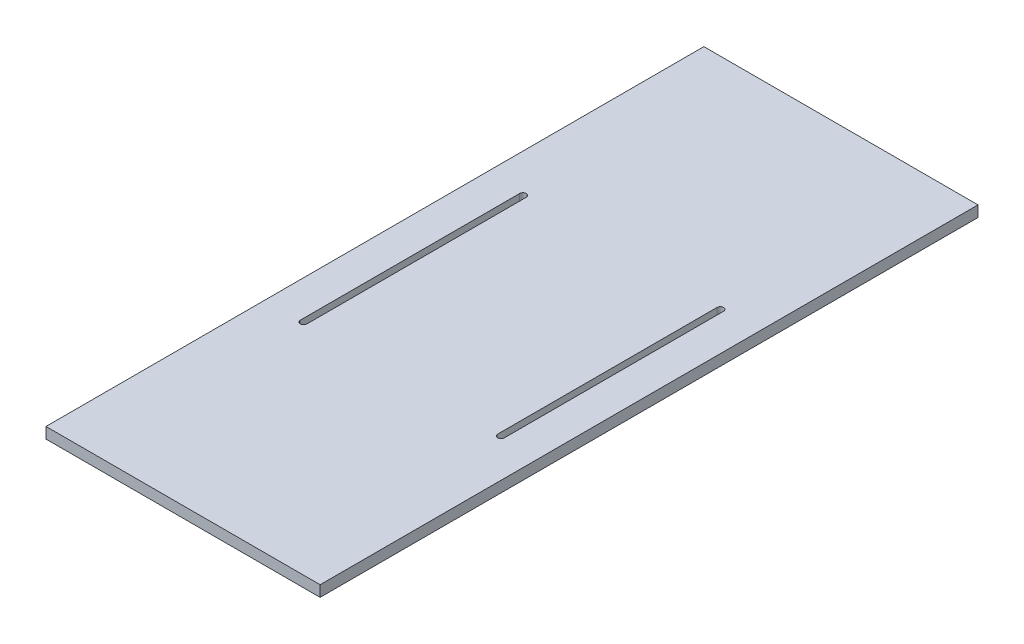
ISO-10303-21;
HEADER;
FILE_DESCRIPTION(('STEP AP214'),'2;1');
FILE_NAME('part.step','',(''),(''),'','','');
FILE_SCHEMA(('AUTOMOTIVE_DESIGN { 1 0 10303 214 1 1 1 1 }'));
ENDSEC;
DATA;
#1=APPLICATION_CONTEXT('core data for automotive mechanical design processes');
#2=APPLICATION_PROTOCOL_DEFINITION('international standard','automotive_design',2000,#1);
#3=PRODUCT_CONTEXT('',#1,'mechanical');
#4=PRODUCT('Part','Part','',(#3));
#5=PRODUCT_RELATED_PRODUCT_CATEGORY('part','',(#4));
#6=PRODUCT_DEFINITION_FORMATION('','',#4);
#7=PRODUCT_DEFINITION_CONTEXT('part definition',#1,'design');
#8=PRODUCT_DEFINITION('design','',#6,#7);
#9=PRODUCT_DEFINITION_SHAPE('','',#8);
#10=(LENGTH_UNIT() NAMED_UNIT(*) SI_UNIT(.MILLI.,.METRE.));
#11=(NAMED_UNIT(*) PLANE_ANGLE_UNIT() SI_UNIT($,.RADIAN.));
#12=(NAMED_UNIT(*) SI_UNIT($,.STERADIAN.) SOLID_ANGLE_UNIT());
#13=UNCERTAINTY_MEASURE_WITH_UNIT(LENGTH_MEASURE(1.E-05),#10,'distance_accuracy_value','');
#14=(GEOMETRIC_REPRESENTATION_CONTEXT(3) GLOBAL_UNCERTAINTY_ASSIGNED_CONTEXT((#13)) GLOBAL_UNIT_ASSIGNED_CONTEXT((#10,
#11,#12)) REPRESENTATION_CONTEXT('',''));
#15=CARTESIAN_POINT('',(0.,0.,0.));
#16=DIRECTION('',(0.,0.,1.));
#17=DIRECTION('',(1.,0.,0.));
#18=AXIS2_PLACEMENT_3D('',#15,#16,#17);
#19=CARTESIAN_POINT('',(-125.,5.,300.));
#20=DIRECTION('',(1.,0.,0.));
#21=DIRECTION('',(0.,0.,-1.));
#22=AXIS2_PLACEMENT_3D('',#19,#20,#21);
#23=PLANE('',#22);
#24=DIRECTION('',(0.,0.,1.));
#25=VECTOR('',#24,1.);
#26=CARTESIAN_POINT('',(-125.,-5.,300.));
#27=LINE('',#26,#25);
#28=CARTESIAN_POINT('',(-125.,-5.,-300.));
#29=VERTEX_POINT('',#28);
#30=CARTESIAN_POINT('',(-125.,-5.,300.));
#31=VERTEX_POINT('',#30);
#32=EDGE_CURVE('E158',#29,#31,#27,.T.);
#33=ORIENTED_EDGE('',*,*,#32,.T.);
#34=DIRECTION('',(0.,-1.,0.));
#35=VECTOR('',#34,1.);
#36=CARTESIAN_POINT('',(-125.,5.,300.));
#37=LINE('',#36,#35);
#38=CARTESIAN_POINT('',(-125.,5.,300.));
#39=VERTEX_POINT('',#38);
#40=EDGE_CURVE('E11',#39,#31,#37,.T.);
#41=ORIENTED_EDGE('',*,*,#40,.F.);
#42=DIRECTION('',(0.,0.,1.));
#43=VECTOR('',#42,1.);
#44=CARTESIAN_POINT('',(-125.,5.,300.));
#45=LINE('',#44,#43);
#46=CARTESIAN_POINT('',(-125.,5.,-300.));
#47=VERTEX_POINT('',#46);
#48=EDGE_CURVE('E191',#47,#39,#45,.T.);
#49=ORIENTED_EDGE('',*,*,#48,.F.);
#50=DIRECTION('',(0.,-1.,0.));
#51=VECTOR('',#50,1.);
#52=CARTESIAN_POINT('',(-125.,5.,-300.));
#53=LINE('',#52,#51);
#54=EDGE_CURVE('E201',#47,#29,#53,.T.);
#55=ORIENTED_EDGE('',*,*,#54,.T.);
#56=EDGE_LOOP('',(#33,#41,#49,#55));
#57=FACE_BOUND('',#56,.T.);
#58=ADVANCED_FACE('F33',(#57),#23,.F.);
#59=CARTESIAN_POINT('',(125.,5.,300.));
#60=DIRECTION('',(0.,0.,-1.));
#61=DIRECTION('',(-1.,0.,0.));
#62=AXIS2_PLACEMENT_3D('',#59,#60,#61);
#63=PLANE('',#62);
#64=DIRECTION('',(1.,0.,0.));
#65=VECTOR('',#64,1.);
#66=CARTESIAN_POINT('',(125.,-5.,300.));
#67=LINE('',#66,#65);
#68=CARTESIAN_POINT('',(125.,-5.,300.));
#69=VERTEX_POINT('',#68);
#70=EDGE_CURVE('E204',#31,#69,#67,.T.);
#71=ORIENTED_EDGE('',*,*,#70,.T.);
#72=DIRECTION('',(0.,-1.,0.));
#73=VECTOR('',#72,1.);
#74=CARTESIAN_POINT('',(125.,5.,300.));
#75=LINE('',#74,#73);
#76=CARTESIAN_POINT('',(125.,5.,300.));
#77=VERTEX_POINT('',#76);
#78=EDGE_CURVE('E40',#77,#69,#75,.T.);
#79=ORIENTED_EDGE('',*,*,#78,.F.);
#80=DIRECTION('',(1.,0.,0.));
#81=VECTOR('',#80,1.);
#82=CARTESIAN_POINT('',(125.,5.,300.));
#83=LINE('',#82,#81);
#84=EDGE_CURVE('E194',#39,#77,#83,.T.);
#85=ORIENTED_EDGE('',*,*,#84,.F.);
#86=ORIENTED_EDGE('',*,*,#40,.T.);
#87=EDGE_LOOP('',(#71,#79,#85,#86));
#88=FACE_BOUND('',#87,.T.);
#89=ADVANCED_FACE('F233',(#88),#63,.F.);
#90=CARTESIAN_POINT('',(125.,5.,300.));
#91=DIRECTION('',(-1.,0.,0.));
#92=DIRECTION('',(0.,0.,1.));
#93=AXIS2_PLACEMENT_3D('',#90,#91,#92);
#94=PLANE('',#93);
#95=DIRECTION('',(0.,0.,-1.));
#96=VECTOR('',#95,1.);
#97=CARTESIAN_POINT('',(125.,-5.,300.));
#98=LINE('',#97,#96);
#99=CARTESIAN_POINT('',(125.,-5.,-300.));
#100=VERTEX_POINT('',#99);
#101=EDGE_CURVE('E206',#69,#100,#98,.T.);
#102=ORIENTED_EDGE('',*,*,#101,.T.);
#103=DIRECTION('',(0.,-1.,0.));
#104=VECTOR('',#103,1.);
#105=CARTESIAN_POINT('',(125.,5.,-300.));
#106=LINE('',#105,#104);
#107=CARTESIAN_POINT('',(125.,5.,-300.));
#108=VERTEX_POINT('',#107);
#109=EDGE_CURVE('E211',#108,#100,#106,.T.);
#110=ORIENTED_EDGE('',*,*,#109,.F.);
#111=DIRECTION('',(0.,0.,-1.));
#112=VECTOR('',#111,1.);
#113=CARTESIAN_POINT('',(125.,5.,300.));
#114=LINE('',#113,#112);
#115=EDGE_CURVE('E197',#77,#108,#114,.T.);
#116=ORIENTED_EDGE('',*,*,#115,.F.);
#117=ORIENTED_EDGE('',*,*,#78,.T.);
#118=EDGE_LOOP('',(#102,#110,#116,#117));
#119=FACE_BOUND('',#118,.T.);
#120=ADVANCED_FACE('F218',(#119),#94,.F.);
#121=CARTESIAN_POINT('',(125.,5.,-300.));
#122=DIRECTION('',(0.,0.,1.));
#123=DIRECTION('',(1.,0.,0.));
#124=AXIS2_PLACEMENT_3D('',#121,#122,#123);
#125=PLANE('',#124);
#126=DIRECTION('',(-1.,0.,0.));
#127=VECTOR('',#126,1.);
#128=CARTESIAN_POINT('',(125.,-5.,-300.));
#129=LINE('',#128,#127);
#130=EDGE_CURVE('E195',#100,#29,#129,.T.);
#131=ORIENTED_EDGE('',*,*,#130,.T.);
#132=ORIENTED_EDGE('',*,*,#54,.F.);
#133=DIRECTION('',(-1.,0.,0.));
#134=VECTOR('',#133,1.);
#135=CARTESIAN_POINT('',(125.,5.,-300.));
#136=LINE('',#135,#134);
#137=EDGE_CURVE('E199',#108,#47,#136,.T.);
#138=ORIENTED_EDGE('',*,*,#137,.F.);
#139=ORIENTED_EDGE('',*,*,#109,.T.);
#140=EDGE_LOOP('',(#131,#132,#138,#139));
#141=FACE_BOUND('',#140,.T.);
#142=ADVANCED_FACE('F226',(#141),#125,.F.);
#143=CARTESIAN_POINT('',(0.,5.,0.));
#144=DIRECTION('',(0.,1.,0.));
#145=DIRECTION('',(0.,0.,1.));
#146=AXIS2_PLACEMENT_3D('',#143,#144,#145);
#147=PLANE('',#146);
#148=CARTESIAN_POINT('',(-90.,5.,-100.));
#149=DIRECTION('',(0.,1.,0.));
#150=DIRECTION('',(0.,0.,1.));
#151=AXIS2_PLACEMENT_3D('',#148,#149,#150);
#152=CIRCLE('',#151,2.99999999999994);
#153=CARTESIAN_POINT('',(-87.0000000000001,5.,-100.));
#154=VERTEX_POINT('',#153);
#155=CARTESIAN_POINT('',(-93.,5.,-100.));
#156=VERTEX_POINT('',#155);
#157=EDGE_CURVE('E47',#154,#156,#152,.T.);
#158=ORIENTED_EDGE('',*,*,#157,.F.);
#159=DIRECTION('',(0.,0.,-1.));
#160=VECTOR('',#159,1.);
#161=CARTESIAN_POINT('',(-87.0000000000001,5.,-100.));
#162=LINE('',#161,#160);
#163=CARTESIAN_POINT('',(-87.,5.,100.));
#164=VERTEX_POINT('',#163);
#165=EDGE_CURVE('E142',#164,#154,#162,.T.);
#166=ORIENTED_EDGE('',*,*,#165,.F.);
#167=CARTESIAN_POINT('',(-90.,5.,100.));
#168=DIRECTION('',(0.,1.,0.));
#169=DIRECTION('',(0.,0.,1.));
#170=AXIS2_PLACEMENT_3D('',#167,#168,#169);
#171=CIRCLE('',#170,2.99999999999994);
#172=CARTESIAN_POINT('',(-92.9999999999999,5.,100.));
#173=VERTEX_POINT('',#172);
#174=EDGE_CURVE('E145',#173,#164,#171,.T.);
#175=ORIENTED_EDGE('',*,*,#174,.F.);
#176=DIRECTION('',(0.,0.,1.));
#177=VECTOR('',#176,1.);
#178=CARTESIAN_POINT('',(-93.,5.,-100.));
#179=LINE('',#178,#177);
#180=EDGE_CURVE('E151',#156,#173,#179,.T.);
#181=ORIENTED_EDGE('',*,*,#180,.F.);
#182=EDGE_LOOP('',(#158,#166,#175,#181));
#183=FACE_BOUND('',#182,.T.);
#184=CARTESIAN_POINT('',(90.,5.,-100.));
#185=DIRECTION('',(0.,1.,0.));
#186=DIRECTION('',(0.,0.,-1.));
#187=AXIS2_PLACEMENT_3D('',#184,#185,#186);
#188=CIRCLE('',#187,2.99999999999994);
#189=CARTESIAN_POINT('',(92.9999999999999,5.,-100.));
#190=VERTEX_POINT('',#189);
#191=CARTESIAN_POINT('',(87.,5.,-100.));
#192=VERTEX_POINT('',#191);
#193=EDGE_CURVE('E55',#190,#192,#188,.T.);
#194=ORIENTED_EDGE('',*,*,#193,.F.);
#195=DIRECTION('',(0.,0.,-1.));
#196=VECTOR('',#195,1.);
#197=CARTESIAN_POINT('',(92.9999999999999,5.,-100.));
#198=LINE('',#197,#196);
#199=CARTESIAN_POINT('',(92.9999999999999,5.,100.));
#200=VERTEX_POINT('',#199);
#201=EDGE_CURVE('E166',#200,#190,#198,.T.);
#202=ORIENTED_EDGE('',*,*,#201,.F.);
#203=CARTESIAN_POINT('',(89.9999999999999,5.,100.));
#204=DIRECTION('',(0.,1.,0.));
#205=DIRECTION('',(0.,0.,-1.));
#206=AXIS2_PLACEMENT_3D('',#203,#204,#205);
#207=CIRCLE('',#206,2.99999999999994);
#208=CARTESIAN_POINT('',(87.,5.,100.));
#209=VERTEX_POINT('',#208);
#210=EDGE_CURVE('E180',#209,#200,#207,.T.);
#211=ORIENTED_EDGE('',*,*,#210,.F.);
#212=DIRECTION('',(0.,0.,1.));
#213=VECTOR('',#212,1.);
#214=CARTESIAN_POINT('',(87.,5.,-100.));
#215=LINE('',#214,#213);
#216=EDGE_CURVE('E177',#192,#209,#215,.T.);
#217=ORIENTED_EDGE('',*,*,#216,.F.);
#218=EDGE_LOOP('',(#194,#202,#211,#217));
#219=FACE_BOUND('',#218,.T.);
#220=ORIENTED_EDGE('',*,*,#48,.T.);
#221=ORIENTED_EDGE('',*,*,#84,.T.);
#222=ORIENTED_EDGE('',*,*,#115,.T.);
#223=ORIENTED_EDGE('',*,*,#137,.T.);
#224=EDGE_LOOP('',(#220,#221,#222,#223));
#225=FACE_BOUND('',#224,.T.);
#226=ADVANCED_FACE('F232',(#183,#219,#225),#147,.T.);
#227=CARTESIAN_POINT('',(0.,-5.,0.));
#228=DIRECTION('',(0.,1.,0.));
#229=DIRECTION('',(0.,0.,1.));
#230=AXIS2_PLACEMENT_3D('',#227,#228,#229);
#231=PLANE('',#230);
#232=DIRECTION('',(0.,0.,-1.));
#233=VECTOR('',#232,1.);
#234=CARTESIAN_POINT('',(-87.0000000000001,-5.,-100.));
#235=LINE('',#234,#233);
#236=CARTESIAN_POINT('',(-87.,-5.,100.));
#237=VERTEX_POINT('',#236);
#238=CARTESIAN_POINT('',(-87.0000000000001,-5.,-100.));
#239=VERTEX_POINT('',#238);
#240=EDGE_CURVE('E129',#237,#239,#235,.T.);
#241=ORIENTED_EDGE('',*,*,#240,.T.);
#242=CARTESIAN_POINT('',(-90.,-5.,-100.));
#243=DIRECTION('',(0.,1.,0.));
#244=DIRECTION('',(0.,0.,1.));
#245=AXIS2_PLACEMENT_3D('',#242,#243,#244);
#246=CIRCLE('',#245,2.99999999999994);
#247=CARTESIAN_POINT('',(-93.,-5.,-100.));
#248=VERTEX_POINT('',#247);
#249=EDGE_CURVE('E123',#239,#248,#246,.T.);
#250=ORIENTED_EDGE('',*,*,#249,.T.);
#251=DIRECTION('',(0.,0.,1.));
#252=VECTOR('',#251,1.);
#253=CARTESIAN_POINT('',(-93.,-5.,-100.));
#254=LINE('',#253,#252);
#255=CARTESIAN_POINT('',(-92.9999999999999,-5.,100.));
#256=VERTEX_POINT('',#255);
#257=EDGE_CURVE('E133',#248,#256,#254,.T.);
#258=ORIENTED_EDGE('',*,*,#257,.T.);
#259=CARTESIAN_POINT('',(-90.,-5.,100.));
#260=DIRECTION('',(0.,1.,0.));
#261=DIRECTION('',(0.,0.,1.));
#262=AXIS2_PLACEMENT_3D('',#259,#260,#261);
#263=CIRCLE('',#262,2.99999999999994);
#264=EDGE_CURVE('E137',#256,#237,#263,.T.);
#265=ORIENTED_EDGE('',*,*,#264,.T.);
#266=EDGE_LOOP('',(#241,#250,#258,#265));
#267=FACE_BOUND('',#266,.T.);
#268=DIRECTION('',(0.,0.,-1.));
#269=VECTOR('',#268,1.);
#270=CARTESIAN_POINT('',(92.9999999999999,-5.,-100.));
#271=LINE('',#270,#269);
#272=CARTESIAN_POINT('',(92.9999999999999,-5.,100.));
#273=VERTEX_POINT('',#272);
#274=CARTESIAN_POINT('',(92.9999999999999,-5.,-100.));
#275=VERTEX_POINT('',#274);
#276=EDGE_CURVE('E172',#273,#275,#271,.T.);
#277=ORIENTED_EDGE('',*,*,#276,.T.);
#278=CARTESIAN_POINT('',(90.,-5.,-100.));
#279=DIRECTION('',(0.,1.,0.));
#280=DIRECTION('',(0.,0.,-1.));
#281=AXIS2_PLACEMENT_3D('',#278,#279,#280);
#282=CIRCLE('',#281,2.99999999999994);
#283=CARTESIAN_POINT('',(87.,-5.,-100.));
#284=VERTEX_POINT('',#283);
#285=EDGE_CURVE('E162',#275,#284,#282,.T.);
#286=ORIENTED_EDGE('',*,*,#285,.T.);
#287=DIRECTION('',(0.,0.,1.));
#288=VECTOR('',#287,1.);
#289=CARTESIAN_POINT('',(87.,-5.,-100.));
#290=LINE('',#289,#288);
#291=CARTESIAN_POINT('',(87.,-5.,100.));
#292=VERTEX_POINT('',#291);
#293=EDGE_CURVE('E165',#284,#292,#290,.T.);
#294=ORIENTED_EDGE('',*,*,#293,.T.);
#295=CARTESIAN_POINT('',(89.9999999999999,-5.,100.));
#296=DIRECTION('',(0.,1.,0.));
#297=DIRECTION('',(0.,0.,-1.));
#298=AXIS2_PLACEMENT_3D('',#295,#296,#297);
#299=CIRCLE('',#298,2.99999999999994);
#300=EDGE_CURVE('E169',#292,#273,#299,.T.);
#301=ORIENTED_EDGE('',*,*,#300,.T.);
#302=EDGE_LOOP('',(#277,#286,#294,#301));
#303=FACE_BOUND('',#302,.T.);
#304=ORIENTED_EDGE('',*,*,#32,.F.);
#305=ORIENTED_EDGE('',*,*,#130,.F.);
#306=ORIENTED_EDGE('',*,*,#101,.F.);
#307=ORIENTED_EDGE('',*,*,#70,.F.);
#308=EDGE_LOOP('',(#304,#305,#306,#307));
#309=FACE_BOUND('',#308,.T.);
#310=ADVANCED_FACE('F139',(#267,#303,#309),#231,.F.);
#311=CARTESIAN_POINT('',(90.,-5.,-100.));
#312=DIRECTION('',(0.,1.,0.));
#313=DIRECTION('',(0.,0.,1.));
#314=AXIS2_PLACEMENT_3D('',#311,#312,#313);
#315=CYLINDRICAL_SURFACE('',#314,2.99999999999994);
#316=ORIENTED_EDGE('',*,*,#193,.T.);
#317=DIRECTION('',(0.,1.,0.));
#318=VECTOR('',#317,1.);
#319=CARTESIAN_POINT('',(87.,-5.,-100.));
#320=LINE('',#319,#318);
#321=EDGE_CURVE('E175',#284,#192,#320,.T.);
#322=ORIENTED_EDGE('',*,*,#321,.F.);
#323=ORIENTED_EDGE('',*,*,#285,.F.);
#324=DIRECTION('',(0.,1.,0.));
#325=VECTOR('',#324,1.);
#326=CARTESIAN_POINT('',(92.9999999999999,-5.,-100.));
#327=LINE('',#326,#325);
#328=EDGE_CURVE('E152',#275,#190,#327,.T.);
#329=ORIENTED_EDGE('',*,*,#328,.T.);
#330=EDGE_LOOP('',(#316,#322,#323,#329));
#331=FACE_BOUND('',#330,.T.);
#332=ADVANCED_FACE('F245',(#331),#315,.F.);
#333=CARTESIAN_POINT('',(92.9999999999999,-5.,-100.));
#334=DIRECTION('',(1.,0.,0.));
#335=DIRECTION('',(0.,0.,-1.));
#336=AXIS2_PLACEMENT_3D('',#333,#334,#335);
#337=PLANE('',#336);
#338=ORIENTED_EDGE('',*,*,#201,.T.);
#339=ORIENTED_EDGE('',*,*,#328,.F.);
#340=ORIENTED_EDGE('',*,*,#276,.F.);
#341=DIRECTION('',(0.,1.,0.));
#342=VECTOR('',#341,1.);
#343=CARTESIAN_POINT('',(92.9999999999999,-5.,100.));
#344=LINE('',#343,#342);
#345=EDGE_CURVE('E186',#273,#200,#344,.T.);
#346=ORIENTED_EDGE('',*,*,#345,.T.);
#347=EDGE_LOOP('',(#338,#339,#340,#346));
#348=FACE_BOUND('',#347,.T.);
#349=ADVANCED_FACE('F251',(#348),#337,.F.);
#350=CARTESIAN_POINT('',(89.9999999999999,-5.,100.));
#351=DIRECTION('',(0.,1.,0.));
#352=DIRECTION('',(0.,0.,1.));
#353=AXIS2_PLACEMENT_3D('',#350,#351,#352);
#354=CYLINDRICAL_SURFACE('',#353,2.99999999999994);
#355=ORIENTED_EDGE('',*,*,#210,.T.);
#356=ORIENTED_EDGE('',*,*,#345,.F.);
#357=ORIENTED_EDGE('',*,*,#300,.F.);
#358=DIRECTION('',(0.,1.,0.));
#359=VECTOR('',#358,1.);
#360=CARTESIAN_POINT('',(87.,-5.,100.));
#361=LINE('',#360,#359);
#362=EDGE_CURVE('E188',#292,#209,#361,.T.);
#363=ORIENTED_EDGE('',*,*,#362,.T.);
#364=EDGE_LOOP('',(#355,#356,#357,#363));
#365=FACE_BOUND('',#364,.T.);
#366=ADVANCED_FACE('F255',(#365),#354,.F.);
#367=CARTESIAN_POINT('',(87.,-5.,-100.));
#368=DIRECTION('',(-1.,0.,0.));
#369=DIRECTION('',(0.,0.,1.));
#370=AXIS2_PLACEMENT_3D('',#367,#368,#369);
#371=PLANE('',#370);
#372=ORIENTED_EDGE('',*,*,#216,.T.);
#373=ORIENTED_EDGE('',*,*,#362,.F.);
#374=ORIENTED_EDGE('',*,*,#293,.F.);
#375=ORIENTED_EDGE('',*,*,#321,.T.);
#376=EDGE_LOOP('',(#372,#373,#374,#375));
#377=FACE_BOUND('',#376,.T.);
#378=ADVANCED_FACE('F252',(#377),#371,.F.);
#379=CARTESIAN_POINT('',(-90.,-5.,-100.));
#380=DIRECTION('',(0.,1.,0.));
#381=DIRECTION('',(0.,0.,1.));
#382=AXIS2_PLACEMENT_3D('',#379,#380,#381);
#383=CYLINDRICAL_SURFACE('',#382,2.99999999999994);
#384=ORIENTED_EDGE('',*,*,#157,.T.);
#385=DIRECTION('',(0.,1.,0.));
#386=VECTOR('',#385,1.);
#387=CARTESIAN_POINT('',(-93.,-5.,-100.));
#388=LINE('',#387,#386);
#389=EDGE_CURVE('E119',#248,#156,#388,.T.);
#390=ORIENTED_EDGE('',*,*,#389,.F.);
#391=ORIENTED_EDGE('',*,*,#249,.F.);
#392=DIRECTION('',(0.,1.,0.));
#393=VECTOR('',#392,1.);
#394=CARTESIAN_POINT('',(-87.0000000000001,-5.,-100.));
#395=LINE('',#394,#393);
#396=EDGE_CURVE('E156',#239,#154,#395,.T.);
#397=ORIENTED_EDGE('',*,*,#396,.T.);
#398=EDGE_LOOP('',(#384,#390,#391,#397));
#399=FACE_BOUND('',#398,.T.);
#400=ADVANCED_FACE('F121',(#399),#383,.F.);
#401=CARTESIAN_POINT('',(-87.0000000000001,-5.,-100.));
#402=DIRECTION('',(1.,0.,0.));
#403=DIRECTION('',(0.,0.,-1.));
#404=AXIS2_PLACEMENT_3D('',#401,#402,#403);
#405=PLANE('',#404);
#406=ORIENTED_EDGE('',*,*,#165,.T.);
#407=ORIENTED_EDGE('',*,*,#396,.F.);
#408=ORIENTED_EDGE('',*,*,#240,.F.);
#409=DIRECTION('',(0.,1.,0.));
#410=VECTOR('',#409,1.);
#411=CARTESIAN_POINT('',(-87.,-5.,100.));
#412=LINE('',#411,#410);
#413=EDGE_CURVE('E159',#237,#164,#412,.T.);
#414=ORIENTED_EDGE('',*,*,#413,.T.);
#415=EDGE_LOOP('',(#406,#407,#408,#414));
#416=FACE_BOUND('',#415,.T.);
#417=ADVANCED_FACE('F265',(#416),#405,.F.);
#418=CARTESIAN_POINT('',(-90.,-5.,100.));
#419=DIRECTION('',(0.,1.,0.));
#420=DIRECTION('',(0.,0.,1.));
#421=AXIS2_PLACEMENT_3D('',#418,#419,#420);
#422=CYLINDRICAL_SURFACE('',#421,2.99999999999994);
#423=ORIENTED_EDGE('',*,*,#174,.T.);
#424=ORIENTED_EDGE('',*,*,#413,.F.);
#425=ORIENTED_EDGE('',*,*,#264,.F.);
#426=DIRECTION('',(0.,1.,0.));
#427=VECTOR('',#426,1.);
#428=CARTESIAN_POINT('',(-92.9999999999999,-5.,100.));
#429=LINE('',#428,#427);
#430=EDGE_CURVE('E128',#256,#173,#429,.T.);
#431=ORIENTED_EDGE('',*,*,#430,.T.);
#432=EDGE_LOOP('',(#423,#424,#425,#431));
#433=FACE_BOUND('',#432,.T.);
#434=ADVANCED_FACE('F268',(#433),#422,.F.);
#435=CARTESIAN_POINT('',(-93.,-5.,-100.));
#436=DIRECTION('',(-1.,0.,0.));
#437=DIRECTION('',(0.,0.,1.));
#438=AXIS2_PLACEMENT_3D('',#435,#436,#437);
#439=PLANE('',#438);
#440=ORIENTED_EDGE('',*,*,#180,.T.);
#441=ORIENTED_EDGE('',*,*,#430,.F.);
#442=ORIENTED_EDGE('',*,*,#257,.F.);
#443=ORIENTED_EDGE('',*,*,#389,.T.);
#444=EDGE_LOOP('',(#440,#441,#442,#443));
#445=FACE_BOUND('',#444,.T.);
#446=ADVANCED_FACE('F134',(#445),#439,.F.);
#447=CLOSED_SHELL('',(#58,#89,#120,#142,#226,#310,#332,#349,#366,#378,#400,#417,#434,#446));
#448=MANIFOLD_SOLID_BREP('B2',#447);
#449=ADVANCED_BREP_SHAPE_REPRESENTATION('',(#18,#448),#14);
#450=SHAPE_DEFINITION_REPRESENTATION(#9,#449);
ENDSEC;
END-ISO-10303-21;
